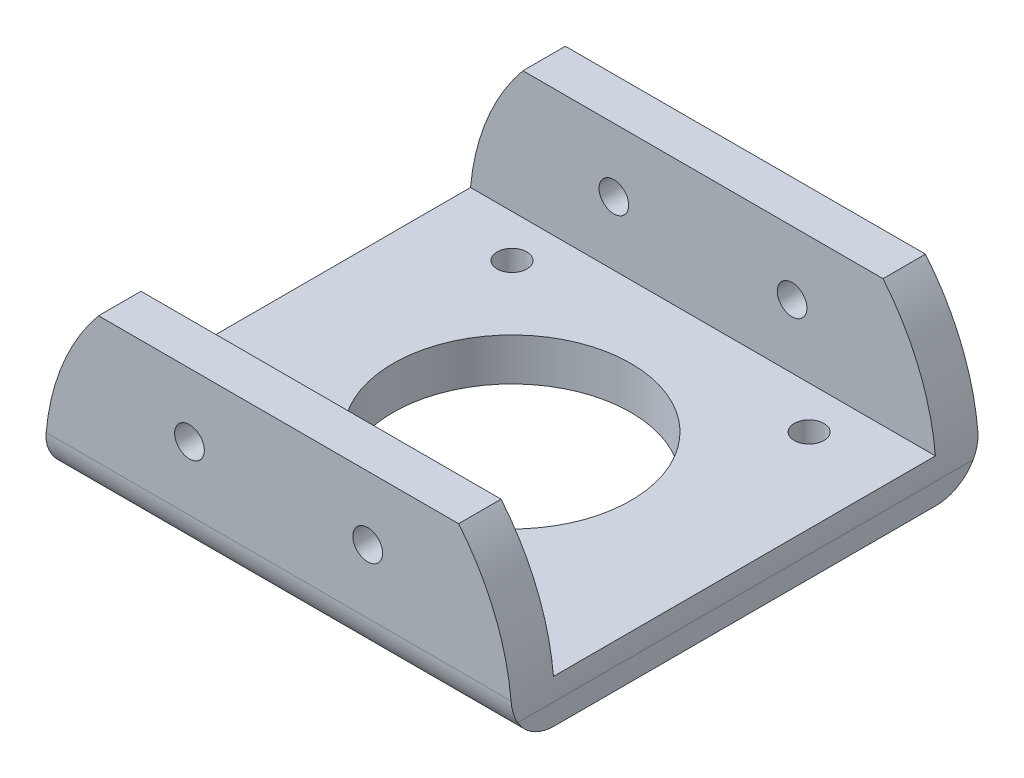
ISO-10303-21;
HEADER;
FILE_DESCRIPTION(('STEP AP214'),'2;1');
FILE_NAME('part.step','',(''),(''),'','','');
FILE_SCHEMA(('AUTOMOTIVE_DESIGN { 1 0 10303 214 1 1 1 1 }'));
ENDSEC;
DATA;
#1=APPLICATION_CONTEXT('core data for automotive mechanical design processes');
#2=APPLICATION_PROTOCOL_DEFINITION('international standard','automotive_design',2000,#1);
#3=PRODUCT_CONTEXT('',#1,'mechanical');
#4=PRODUCT('Part','Part','',(#3));
#5=PRODUCT_RELATED_PRODUCT_CATEGORY('part','',(#4));
#6=PRODUCT_DEFINITION_FORMATION('','',#4);
#7=PRODUCT_DEFINITION_CONTEXT('part definition',#1,'design');
#8=PRODUCT_DEFINITION('design','',#6,#7);
#9=PRODUCT_DEFINITION_SHAPE('','',#8);
#10=(LENGTH_UNIT() NAMED_UNIT(*) SI_UNIT(.MILLI.,.METRE.));
#11=(NAMED_UNIT(*) PLANE_ANGLE_UNIT() SI_UNIT($,.RADIAN.));
#12=(NAMED_UNIT(*) SI_UNIT($,.STERADIAN.) SOLID_ANGLE_UNIT());
#13=UNCERTAINTY_MEASURE_WITH_UNIT(LENGTH_MEASURE(1.E-05),#10,'distance_accuracy_value','');
#14=(GEOMETRIC_REPRESENTATION_CONTEXT(3) GLOBAL_UNCERTAINTY_ASSIGNED_CONTEXT((#13)) GLOBAL_UNIT_ASSIGNED_CONTEXT((#10,
#11,#12)) REPRESENTATION_CONTEXT('',''));
#15=CARTESIAN_POINT('',(0.,0.,0.));
#16=DIRECTION('',(0.,0.,1.));
#17=DIRECTION('',(1.,0.,0.));
#18=AXIS2_PLACEMENT_3D('',#15,#16,#17);
#19=CARTESIAN_POINT('',(27.5,5.,27.5));
#20=DIRECTION('',(-1.,0.,0.));
#21=DIRECTION('',(0.,0.,1.));
#22=AXIS2_PLACEMENT_3D('',#19,#20,#21);
#23=PLANE('',#22);
#24=DIRECTION('',(0.,0.,1.));
#25=VECTOR('',#24,1.);
#26=CARTESIAN_POINT('',(27.5,2.50000000000002,-27.5));
#27=LINE('',#26,#25);
#28=CARTESIAN_POINT('',(27.5,2.50000000000002,-26.8301270189222));
#29=VERTEX_POINT('',#28);
#30=CARTESIAN_POINT('',(27.5,2.50000000000002,26.8301270189222));
#31=VERTEX_POINT('',#30);
#32=EDGE_CURVE('E139',#29,#31,#27,.T.);
#33=ORIENTED_EDGE('',*,*,#32,.T.);
#34=CARTESIAN_POINT('',(27.5,5.,22.5));
#35=DIRECTION('',(-1.,0.,0.));
#36=DIRECTION('',(0.,0.,1.));
#37=AXIS2_PLACEMENT_3D('',#34,#35,#36);
#38=CIRCLE('',#37,5.);
#39=CARTESIAN_POINT('',(27.5,0.,22.5));
#40=VERTEX_POINT('',#39);
#41=EDGE_CURVE('E210',#31,#40,#38,.F.);
#42=ORIENTED_EDGE('',*,*,#41,.T.);
#43=DIRECTION('',(0.,0.,-1.));
#44=VECTOR('',#43,1.);
#45=CARTESIAN_POINT('',(27.5,0.,27.5));
#46=LINE('',#45,#44);
#47=CARTESIAN_POINT('',(27.5,0.,-22.5));
#48=VERTEX_POINT('',#47);
#49=EDGE_CURVE('E191',#40,#48,#46,.T.);
#50=ORIENTED_EDGE('',*,*,#49,.T.);
#51=CARTESIAN_POINT('',(27.5,5.,-22.5));
#52=DIRECTION('',(-1.,0.,0.));
#53=DIRECTION('',(0.,0.,1.));
#54=AXIS2_PLACEMENT_3D('',#51,#52,#53);
#55=CIRCLE('',#54,5.);
#56=EDGE_CURVE('E212',#48,#29,#55,.F.);
#57=ORIENTED_EDGE('',*,*,#56,.T.);
#58=EDGE_LOOP('',(#33,#42,#50,#57));
#59=FACE_BOUND('',#58,.T.);
#60=ADVANCED_FACE('F36',(#59),#23,.F.);
#61=CARTESIAN_POINT('',(0.,5.,0.));
#62=DIRECTION('',(0.,-1.,0.));
#63=DIRECTION('',(0.,0.,-1.));
#64=AXIS2_PLACEMENT_3D('',#61,#62,#63);
#65=PLANE('',#64);
#66=CARTESIAN_POINT('',(-17.5000000000002,5.,17.4999999999998));
#67=DIRECTION('',(0.,1.,0.));
#68=DIRECTION('',(0.,0.,1.));
#69=AXIS2_PLACEMENT_3D('',#66,#67,#68);
#70=CIRCLE('',#69,1.75);
#71=CARTESIAN_POINT('',(-17.5000000000002,5.,19.2499999999998));
#72=VERTEX_POINT('',#71);
#73=EDGE_CURVE('E158',#72,#72,#70,.T.);
#74=ORIENTED_EDGE('',*,*,#73,.F.);
#75=EDGE_LOOP('',(#74));
#76=FACE_BOUND('',#75,.T.);
#77=CARTESIAN_POINT('',(17.4999999999999,5.,17.5000000000001));
#78=DIRECTION('',(0.,1.,0.));
#79=DIRECTION('',(0.,0.,1.));
#80=AXIS2_PLACEMENT_3D('',#77,#78,#79);
#81=CIRCLE('',#80,1.75);
#82=CARTESIAN_POINT('',(17.4999999999999,5.,19.2500000000001));
#83=VERTEX_POINT('',#82);
#84=EDGE_CURVE('E180',#83,#83,#81,.T.);
#85=ORIENTED_EDGE('',*,*,#84,.F.);
#86=EDGE_LOOP('',(#85));
#87=FACE_BOUND('',#86,.T.);
#88=CARTESIAN_POINT('',(17.5000000000001,5.,-17.5));
#89=DIRECTION('',(0.,1.,0.));
#90=DIRECTION('',(0.,0.,1.));
#91=AXIS2_PLACEMENT_3D('',#88,#89,#90);
#92=CIRCLE('',#91,1.75);
#93=CARTESIAN_POINT('',(17.5000000000001,5.,-15.75));
#94=VERTEX_POINT('',#93);
#95=EDGE_CURVE('E174',#94,#94,#92,.T.);
#96=ORIENTED_EDGE('',*,*,#95,.F.);
#97=EDGE_LOOP('',(#96));
#98=FACE_BOUND('',#97,.T.);
#99=CARTESIAN_POINT('',(-17.5,5.,-17.5));
#100=DIRECTION('',(0.,1.,0.));
#101=DIRECTION('',(0.,0.,1.));
#102=AXIS2_PLACEMENT_3D('',#99,#100,#101);
#103=CIRCLE('',#102,1.75);
#104=CARTESIAN_POINT('',(-17.5,5.,-15.75));
#105=VERTEX_POINT('',#104);
#106=EDGE_CURVE('E167',#105,#105,#103,.T.);
#107=ORIENTED_EDGE('',*,*,#106,.F.);
#108=EDGE_LOOP('',(#107));
#109=FACE_BOUND('',#108,.T.);
#110=CARTESIAN_POINT('',(0.,5.,0.));
#111=DIRECTION('',(0.,1.,0.));
#112=DIRECTION('',(0.,0.,1.));
#113=AXIS2_PLACEMENT_3D('',#110,#111,#112);
#114=CIRCLE('',#113,14.);
#115=CARTESIAN_POINT('',(0.,5.,14.));
#116=VERTEX_POINT('',#115);
#117=EDGE_CURVE('E188',#116,#116,#114,.T.);
#118=ORIENTED_EDGE('',*,*,#117,.F.);
#119=EDGE_LOOP('',(#118));
#120=FACE_BOUND('',#119,.T.);
#121=DIRECTION('',(-1.,0.,0.));
#122=VECTOR('',#121,1.);
#123=CARTESIAN_POINT('',(-27.5,5.,22.5));
#124=LINE('',#123,#122);
#125=CARTESIAN_POINT('',(27.3861278752583,5.,22.5));
#126=VERTEX_POINT('',#125);
#127=CARTESIAN_POINT('',(-27.3861278752583,5.,22.5));
#128=VERTEX_POINT('',#127);
#129=EDGE_CURVE('E289',#126,#128,#124,.T.);
#130=ORIENTED_EDGE('',*,*,#129,.F.);
#131=DIRECTION('',(0.,0.,1.));
#132=VECTOR('',#131,1.);
#133=CARTESIAN_POINT('',(27.3861278752583,5.,-27.5));
#134=LINE('',#133,#132);
#135=CARTESIAN_POINT('',(27.3861278752583,5.,-22.5));
#136=VERTEX_POINT('',#135);
#137=EDGE_CURVE('E269',#126,#136,#134,.F.);
#138=ORIENTED_EDGE('',*,*,#137,.T.);
#139=DIRECTION('',(1.,0.,0.));
#140=VECTOR('',#139,1.);
#141=CARTESIAN_POINT('',(-27.5,5.,-22.5));
#142=LINE('',#141,#140);
#143=CARTESIAN_POINT('',(-27.3861278752583,5.,-22.5));
#144=VERTEX_POINT('',#143);
#145=EDGE_CURVE('E160',#144,#136,#142,.T.);
#146=ORIENTED_EDGE('',*,*,#145,.F.);
#147=DIRECTION('',(0.,0.,1.));
#148=VECTOR('',#147,1.);
#149=CARTESIAN_POINT('',(-27.3861278752583,5.,-27.5));
#150=LINE('',#149,#148);
#151=EDGE_CURVE('E304',#144,#128,#150,.T.);
#152=ORIENTED_EDGE('',*,*,#151,.T.);
#153=EDGE_LOOP('',(#130,#138,#146,#152));
#154=FACE_BOUND('',#153,.T.);
#155=ADVANCED_FACE('F302',(#76,#87,#98,#109,#120,#154),#65,.F.);
#156=CARTESIAN_POINT('',(-27.5,5.,-27.5));
#157=DIRECTION('',(0.,0.,1.));
#158=DIRECTION('',(1.,0.,0.));
#159=AXIS2_PLACEMENT_3D('',#156,#157,#158);
#160=PLANE('',#159);
#161=CARTESIAN_POINT('',(10.5,12.5,-27.5));
#162=DIRECTION('',(0.,0.,-1.));
#163=DIRECTION('',(-1.,0.,0.));
#164=AXIS2_PLACEMENT_3D('',#161,#162,#163);
#165=CIRCLE('',#164,1.75);
#166=CARTESIAN_POINT('',(8.75,12.5,-27.5));
#167=VERTEX_POINT('',#166);
#168=EDGE_CURVE('E277',#167,#167,#165,.T.);
#169=ORIENTED_EDGE('',*,*,#168,.F.);
#170=EDGE_LOOP('',(#169));
#171=FACE_BOUND('',#170,.T.);
#172=CARTESIAN_POINT('',(-10.5,12.5,-27.5));
#173=DIRECTION('',(0.,0.,-1.));
#174=DIRECTION('',(1.,0.,0.));
#175=AXIS2_PLACEMENT_3D('',#172,#173,#174);
#176=CIRCLE('',#175,1.75);
#177=CARTESIAN_POINT('',(-8.75,12.5,-27.5));
#178=VERTEX_POINT('',#177);
#179=EDGE_CURVE('E274',#178,#178,#176,.T.);
#180=ORIENTED_EDGE('',*,*,#179,.F.);
#181=EDGE_LOOP('',(#180));
#182=FACE_BOUND('',#181,.T.);
#183=DIRECTION('',(-1.,0.,0.));
#184=VECTOR('',#183,1.);
#185=CARTESIAN_POINT('',(-27.5,20.,-27.5));
#186=LINE('',#185,#184);
#187=CARTESIAN_POINT('',(21.2132034355965,20.,-27.5));
#188=VERTEX_POINT('',#187);
#189=CARTESIAN_POINT('',(-21.2132034355964,20.,-27.5));
#190=VERTEX_POINT('',#189);
#191=EDGE_CURVE('E146',#188,#190,#186,.T.);
#192=ORIENTED_EDGE('',*,*,#191,.F.);
#193=CARTESIAN_POINT('',(0.,2.50000000000002,-27.5));
#194=DIRECTION('',(0.,0.,-1.));
#195=DIRECTION('',(1.,0.,0.));
#196=AXIS2_PLACEMENT_3D('',#193,#194,#195);
#197=CIRCLE('',#196,27.5);
#198=CARTESIAN_POINT('',(27.3861278752583,5.,-27.5));
#199=VERTEX_POINT('',#198);
#200=EDGE_CURVE('E128',#188,#199,#197,.T.);
#201=ORIENTED_EDGE('',*,*,#200,.T.);
#202=DIRECTION('',(-1.,0.,0.));
#203=VECTOR('',#202,1.);
#204=CARTESIAN_POINT('',(-27.5,5.,-27.5));
#205=LINE('',#204,#203);
#206=CARTESIAN_POINT('',(-27.3861278752583,5.,-27.5));
#207=VERTEX_POINT('',#206);
#208=EDGE_CURVE('E199',#199,#207,#205,.T.);
#209=ORIENTED_EDGE('',*,*,#208,.T.);
#210=CARTESIAN_POINT('',(0.,2.50000000000002,-27.5));
#211=DIRECTION('',(0.,0.,-1.));
#212=DIRECTION('',(1.,0.,0.));
#213=AXIS2_PLACEMENT_3D('',#210,#211,#212);
#214=CIRCLE('',#213,27.5);
#215=EDGE_CURVE('E154',#207,#190,#214,.T.);
#216=ORIENTED_EDGE('',*,*,#215,.T.);
#217=EDGE_LOOP('',(#192,#201,#209,#216));
#218=FACE_BOUND('',#217,.T.);
#219=ADVANCED_FACE('F153',(#171,#182,#218),#160,.F.);
#220=CARTESIAN_POINT('',(-27.5,5.,27.5));
#221=DIRECTION('',(1.,0.,0.));
#222=DIRECTION('',(0.,0.,-1.));
#223=AXIS2_PLACEMENT_3D('',#220,#221,#222);
#224=PLANE('',#223);
#225=CARTESIAN_POINT('',(-27.5,5.,22.5));
#226=DIRECTION('',(1.,0.,0.));
#227=DIRECTION('',(0.,0.,-1.));
#228=AXIS2_PLACEMENT_3D('',#225,#226,#227);
#229=CIRCLE('',#228,5.);
#230=CARTESIAN_POINT('',(-27.5,0.,22.5));
#231=VERTEX_POINT('',#230);
#232=CARTESIAN_POINT('',(-27.5,2.50000000000002,26.8301270189222));
#233=VERTEX_POINT('',#232);
#234=EDGE_CURVE('E201',#231,#233,#229,.F.);
#235=ORIENTED_EDGE('',*,*,#234,.T.);
#236=DIRECTION('',(0.,0.,1.));
#237=VECTOR('',#236,1.);
#238=CARTESIAN_POINT('',(-27.5,2.50000000000002,-27.5));
#239=LINE('',#238,#237);
#240=CARTESIAN_POINT('',(-27.5,2.50000000000002,-26.8301270189222));
#241=VERTEX_POINT('',#240);
#242=EDGE_CURVE('E64',#241,#233,#239,.T.);
#243=ORIENTED_EDGE('',*,*,#242,.F.);
#244=CARTESIAN_POINT('',(-27.5,5.,-22.5));
#245=DIRECTION('',(1.,0.,0.));
#246=DIRECTION('',(0.,0.,-1.));
#247=AXIS2_PLACEMENT_3D('',#244,#245,#246);
#248=CIRCLE('',#247,5.);
#249=CARTESIAN_POINT('',(-27.5,0.,-22.5));
#250=VERTEX_POINT('',#249);
#251=EDGE_CURVE('E204',#241,#250,#248,.F.);
#252=ORIENTED_EDGE('',*,*,#251,.T.);
#253=DIRECTION('',(0.,0.,1.));
#254=VECTOR('',#253,1.);
#255=CARTESIAN_POINT('',(-27.5,0.,27.5));
#256=LINE('',#255,#254);
#257=EDGE_CURVE('E196',#250,#231,#256,.T.);
#258=ORIENTED_EDGE('',*,*,#257,.T.);
#259=EDGE_LOOP('',(#235,#243,#252,#258));
#260=FACE_BOUND('',#259,.T.);
#261=ADVANCED_FACE('F341',(#260),#224,.F.);
#262=CARTESIAN_POINT('',(-27.5,5.,27.5));
#263=DIRECTION('',(0.,0.,-1.));
#264=DIRECTION('',(-1.,0.,0.));
#265=AXIS2_PLACEMENT_3D('',#262,#263,#264);
#266=PLANE('',#265);
#267=CARTESIAN_POINT('',(10.5,12.5,27.5));
#268=DIRECTION('',(0.,0.,-1.));
#269=DIRECTION('',(-1.,0.,0.));
#270=AXIS2_PLACEMENT_3D('',#267,#268,#269);
#271=CIRCLE('',#270,1.75);
#272=CARTESIAN_POINT('',(8.75,12.5,27.5));
#273=VERTEX_POINT('',#272);
#274=EDGE_CURVE('E222',#273,#273,#271,.T.);
#275=ORIENTED_EDGE('',*,*,#274,.T.);
#276=EDGE_LOOP('',(#275));
#277=FACE_BOUND('',#276,.T.);
#278=CARTESIAN_POINT('',(-10.5,12.5,27.5));
#279=DIRECTION('',(0.,0.,-1.));
#280=DIRECTION('',(1.,0.,0.));
#281=AXIS2_PLACEMENT_3D('',#278,#279,#280);
#282=CIRCLE('',#281,1.75);
#283=CARTESIAN_POINT('',(-8.75,12.5,27.5));
#284=VERTEX_POINT('',#283);
#285=EDGE_CURVE('E280',#284,#284,#282,.T.);
#286=ORIENTED_EDGE('',*,*,#285,.T.);
#287=EDGE_LOOP('',(#286));
#288=FACE_BOUND('',#287,.T.);
#289=DIRECTION('',(1.,0.,0.));
#290=VECTOR('',#289,1.);
#291=CARTESIAN_POINT('',(27.5,5.,27.5));
#292=LINE('',#291,#290);
#293=CARTESIAN_POINT('',(-27.3861278752583,5.,27.5));
#294=VERTEX_POINT('',#293);
#295=CARTESIAN_POINT('',(27.3861278752583,5.,27.5));
#296=VERTEX_POINT('',#295);
#297=EDGE_CURVE('E215',#294,#296,#292,.T.);
#298=ORIENTED_EDGE('',*,*,#297,.T.);
#299=CARTESIAN_POINT('',(0.,2.50000000000002,27.5));
#300=DIRECTION('',(0.,0.,-1.));
#301=DIRECTION('',(1.,0.,0.));
#302=AXIS2_PLACEMENT_3D('',#299,#300,#301);
#303=CIRCLE('',#302,27.5);
#304=CARTESIAN_POINT('',(21.2132034355965,20.,27.5));
#305=VERTEX_POINT('',#304);
#306=EDGE_CURVE('E56',#305,#296,#303,.T.);
#307=ORIENTED_EDGE('',*,*,#306,.F.);
#308=DIRECTION('',(1.,0.,0.));
#309=VECTOR('',#308,1.);
#310=CARTESIAN_POINT('',(-27.5,20.,27.5));
#311=LINE('',#310,#309);
#312=CARTESIAN_POINT('',(-21.2132034355964,20.,27.5));
#313=VERTEX_POINT('',#312);
#314=EDGE_CURVE('E290',#313,#305,#311,.T.);
#315=ORIENTED_EDGE('',*,*,#314,.F.);
#316=CARTESIAN_POINT('',(0.,2.50000000000002,27.5));
#317=DIRECTION('',(0.,0.,-1.));
#318=DIRECTION('',(1.,0.,0.));
#319=AXIS2_PLACEMENT_3D('',#316,#317,#318);
#320=CIRCLE('',#319,27.5);
#321=EDGE_CURVE('E312',#294,#313,#320,.T.);
#322=ORIENTED_EDGE('',*,*,#321,.F.);
#323=EDGE_LOOP('',(#298,#307,#315,#322));
#324=FACE_BOUND('',#323,.T.);
#325=ADVANCED_FACE('F322',(#277,#288,#324),#266,.F.);
#326=CARTESIAN_POINT('',(0.,0.,0.));
#327=DIRECTION('',(0.,-1.,0.));
#328=DIRECTION('',(0.,0.,-1.));
#329=AXIS2_PLACEMENT_3D('',#326,#327,#328);
#330=PLANE('',#329);
#331=CARTESIAN_POINT('',(-17.5000000000002,0.,17.4999999999998));
#332=DIRECTION('',(0.,-1.,0.));
#333=DIRECTION('',(0.,0.,-1.));
#334=AXIS2_PLACEMENT_3D('',#331,#332,#333);
#335=CIRCLE('',#334,1.75);
#336=CARTESIAN_POINT('',(-17.5000000000002,0.,15.7499999999998));
#337=VERTEX_POINT('',#336);
#338=EDGE_CURVE('E155',#337,#337,#335,.F.);
#339=ORIENTED_EDGE('',*,*,#338,.T.);
#340=EDGE_LOOP('',(#339));
#341=FACE_BOUND('',#340,.T.);
#342=CARTESIAN_POINT('',(17.4999999999999,0.,17.5000000000001));
#343=DIRECTION('',(0.,-1.,0.));
#344=DIRECTION('',(0.,0.,-1.));
#345=AXIS2_PLACEMENT_3D('',#342,#343,#344);
#346=CIRCLE('',#345,1.75);
#347=CARTESIAN_POINT('',(17.4999999999999,0.,15.7500000000001));
#348=VERTEX_POINT('',#347);
#349=EDGE_CURVE('E183',#348,#348,#346,.F.);
#350=ORIENTED_EDGE('',*,*,#349,.T.);
#351=EDGE_LOOP('',(#350));
#352=FACE_BOUND('',#351,.T.);
#353=CARTESIAN_POINT('',(17.5000000000001,0.,-17.5));
#354=DIRECTION('',(0.,-1.,0.));
#355=DIRECTION('',(0.,0.,-1.));
#356=AXIS2_PLACEMENT_3D('',#353,#354,#355);
#357=CIRCLE('',#356,1.75);
#358=CARTESIAN_POINT('',(17.5000000000001,0.,-19.2499999999999));
#359=VERTEX_POINT('',#358);
#360=EDGE_CURVE('E177',#359,#359,#357,.F.);
#361=ORIENTED_EDGE('',*,*,#360,.T.);
#362=EDGE_LOOP('',(#361));
#363=FACE_BOUND('',#362,.T.);
#364=CARTESIAN_POINT('',(-17.5,0.,-17.5));
#365=DIRECTION('',(0.,-1.,0.));
#366=DIRECTION('',(0.,0.,-1.));
#367=AXIS2_PLACEMENT_3D('',#364,#365,#366);
#368=CIRCLE('',#367,1.75);
#369=CARTESIAN_POINT('',(-17.5,0.,-19.25));
#370=VERTEX_POINT('',#369);
#371=EDGE_CURVE('E171',#370,#370,#368,.F.);
#372=ORIENTED_EDGE('',*,*,#371,.T.);
#373=EDGE_LOOP('',(#372));
#374=FACE_BOUND('',#373,.T.);
#375=CARTESIAN_POINT('',(0.,0.,0.));
#376=DIRECTION('',(0.,-1.,0.));
#377=DIRECTION('',(0.,0.,-1.));
#378=AXIS2_PLACEMENT_3D('',#375,#376,#377);
#379=CIRCLE('',#378,14.);
#380=CARTESIAN_POINT('',(0.,0.,-14.));
#381=VERTEX_POINT('',#380);
#382=EDGE_CURVE('E170',#381,#381,#379,.F.);
#383=ORIENTED_EDGE('',*,*,#382,.T.);
#384=EDGE_LOOP('',(#383));
#385=FACE_BOUND('',#384,.T.);
#386=ORIENTED_EDGE('',*,*,#257,.F.);
#387=DIRECTION('',(-1.,0.,0.));
#388=VECTOR('',#387,1.);
#389=CARTESIAN_POINT('',(27.5,0.,-22.5));
#390=LINE('',#389,#388);
#391=EDGE_CURVE('E208',#250,#48,#390,.F.);
#392=ORIENTED_EDGE('',*,*,#391,.T.);
#393=ORIENTED_EDGE('',*,*,#49,.F.);
#394=DIRECTION('',(1.,0.,0.));
#395=VECTOR('',#394,1.);
#396=CARTESIAN_POINT('',(-27.5,0.,22.5));
#397=LINE('',#396,#395);
#398=EDGE_CURVE('E206',#40,#231,#397,.F.);
#399=ORIENTED_EDGE('',*,*,#398,.T.);
#400=EDGE_LOOP('',(#386,#392,#393,#399));
#401=FACE_BOUND('',#400,.T.);
#402=ADVANCED_FACE('F349',(#341,#352,#363,#374,#385,#401),#330,.T.);
#403=CARTESIAN_POINT('',(0.,-0.00100000000000013,0.));
#404=DIRECTION('',(0.,1.,0.));
#405=DIRECTION('',(0.,0.,1.));
#406=AXIS2_PLACEMENT_3D('',#403,#404,#405);
#407=CYLINDRICAL_SURFACE('',#406,14.);
#408=ORIENTED_EDGE('',*,*,#382,.F.);
#409=EDGE_LOOP('',(#408));
#410=FACE_BOUND('',#409,.T.);
#411=ORIENTED_EDGE('',*,*,#117,.T.);
#412=EDGE_LOOP('',(#411));
#413=FACE_BOUND('',#412,.T.);
#414=ADVANCED_FACE('F347',(#410,#413),#407,.F.);
#415=CARTESIAN_POINT('',(-17.5,-0.00100000000000013,-17.5));
#416=DIRECTION('',(0.,1.,0.));
#417=DIRECTION('',(0.,0.,1.));
#418=AXIS2_PLACEMENT_3D('',#415,#416,#417);
#419=CYLINDRICAL_SURFACE('',#418,1.75);
#420=ORIENTED_EDGE('',*,*,#371,.F.);
#421=EDGE_LOOP('',(#420));
#422=FACE_BOUND('',#421,.T.);
#423=ORIENTED_EDGE('',*,*,#106,.T.);
#424=EDGE_LOOP('',(#423));
#425=FACE_BOUND('',#424,.T.);
#426=ADVANCED_FACE('F406',(#422,#425),#419,.F.);
#427=CARTESIAN_POINT('',(17.5000000000001,-0.00100000000000013,-17.5));
#428=DIRECTION('',(0.,1.,0.));
#429=DIRECTION('',(0.,0.,1.));
#430=AXIS2_PLACEMENT_3D('',#427,#428,#429);
#431=CYLINDRICAL_SURFACE('',#430,1.75);
#432=ORIENTED_EDGE('',*,*,#360,.F.);
#433=EDGE_LOOP('',(#432));
#434=FACE_BOUND('',#433,.T.);
#435=ORIENTED_EDGE('',*,*,#95,.T.);
#436=EDGE_LOOP('',(#435));
#437=FACE_BOUND('',#436,.T.);
#438=ADVANCED_FACE('F409',(#434,#437),#431,.F.);
#439=CARTESIAN_POINT('',(17.4999999999999,-0.00100000000000013,17.5000000000001));
#440=DIRECTION('',(0.,1.,0.));
#441=DIRECTION('',(0.,0.,1.));
#442=AXIS2_PLACEMENT_3D('',#439,#440,#441);
#443=CYLINDRICAL_SURFACE('',#442,1.75);
#444=ORIENTED_EDGE('',*,*,#349,.F.);
#445=EDGE_LOOP('',(#444));
#446=FACE_BOUND('',#445,.T.);
#447=ORIENTED_EDGE('',*,*,#84,.T.);
#448=EDGE_LOOP('',(#447));
#449=FACE_BOUND('',#448,.T.);
#450=ADVANCED_FACE('F403',(#446,#449),#443,.F.);
#451=CARTESIAN_POINT('',(-17.5000000000002,-0.00100000000000013,17.4999999999998));
#452=DIRECTION('',(0.,1.,0.));
#453=DIRECTION('',(0.,0.,1.));
#454=AXIS2_PLACEMENT_3D('',#451,#452,#453);
#455=CYLINDRICAL_SURFACE('',#454,1.75);
#456=ORIENTED_EDGE('',*,*,#338,.F.);
#457=EDGE_LOOP('',(#456));
#458=FACE_BOUND('',#457,.T.);
#459=ORIENTED_EDGE('',*,*,#73,.T.);
#460=EDGE_LOOP('',(#459));
#461=FACE_BOUND('',#460,.T.);
#462=ADVANCED_FACE('F395',(#458,#461),#455,.F.);
#463=CARTESIAN_POINT('',(-27.5,20.,-22.5));
#464=DIRECTION('',(0.,0.,-1.));
#465=DIRECTION('',(-1.,0.,0.));
#466=AXIS2_PLACEMENT_3D('',#463,#464,#465);
#467=PLANE('',#466);
#468=CARTESIAN_POINT('',(10.5,12.5,-22.5));
#469=DIRECTION('',(0.,0.,-1.));
#470=DIRECTION('',(-1.,0.,0.));
#471=AXIS2_PLACEMENT_3D('',#468,#469,#470);
#472=CIRCLE('',#471,1.75);
#473=CARTESIAN_POINT('',(8.75,12.5,-22.5));
#474=VERTEX_POINT('',#473);
#475=EDGE_CURVE('E225',#474,#474,#472,.T.);
#476=ORIENTED_EDGE('',*,*,#475,.T.);
#477=EDGE_LOOP('',(#476));
#478=FACE_BOUND('',#477,.T.);
#479=CARTESIAN_POINT('',(-10.5,12.5,-22.5));
#480=DIRECTION('',(0.,0.,-1.));
#481=DIRECTION('',(-1.,0.,0.));
#482=AXIS2_PLACEMENT_3D('',#479,#480,#481);
#483=CIRCLE('',#482,1.75);
#484=CARTESIAN_POINT('',(-12.25,12.5,-22.5));
#485=VERTEX_POINT('',#484);
#486=EDGE_CURVE('E221',#485,#485,#483,.T.);
#487=ORIENTED_EDGE('',*,*,#486,.T.);
#488=EDGE_LOOP('',(#487));
#489=FACE_BOUND('',#488,.T.);
#490=ORIENTED_EDGE('',*,*,#145,.T.);
#491=CARTESIAN_POINT('',(0.,2.50000000000002,-22.5));
#492=DIRECTION('',(0.,0.,-1.));
#493=DIRECTION('',(-1.,0.,0.));
#494=AXIS2_PLACEMENT_3D('',#491,#492,#493);
#495=CIRCLE('',#494,27.5);
#496=CARTESIAN_POINT('',(21.2132034355965,20.,-22.5));
#497=VERTEX_POINT('',#496);
#498=EDGE_CURVE('E272',#136,#497,#495,.F.);
#499=ORIENTED_EDGE('',*,*,#498,.T.);
#500=DIRECTION('',(1.,0.,0.));
#501=VECTOR('',#500,1.);
#502=CARTESIAN_POINT('',(-27.5,20.,-22.5));
#503=LINE('',#502,#501);
#504=CARTESIAN_POINT('',(-21.2132034355964,20.,-22.5));
#505=VERTEX_POINT('',#504);
#506=EDGE_CURVE('E148',#505,#497,#503,.T.);
#507=ORIENTED_EDGE('',*,*,#506,.F.);
#508=CARTESIAN_POINT('',(0.,2.50000000000002,-22.5));
#509=DIRECTION('',(0.,0.,-1.));
#510=DIRECTION('',(-1.,0.,0.));
#511=AXIS2_PLACEMENT_3D('',#508,#509,#510);
#512=CIRCLE('',#511,27.5);
#513=EDGE_CURVE('E266',#505,#144,#512,.F.);
#514=ORIENTED_EDGE('',*,*,#513,.T.);
#515=EDGE_LOOP('',(#490,#499,#507,#514));
#516=FACE_BOUND('',#515,.T.);
#517=ADVANCED_FACE('F307',(#478,#489,#516),#467,.F.);
#518=CARTESIAN_POINT('',(0.,20.,0.));
#519=DIRECTION('',(0.,1.,0.));
#520=DIRECTION('',(0.,0.,1.));
#521=AXIS2_PLACEMENT_3D('',#518,#519,#520);
#522=PLANE('',#521);
#523=DIRECTION('',(0.,0.,1.));
#524=VECTOR('',#523,1.);
#525=CARTESIAN_POINT('',(21.2132034355965,20.,-27.5));
#526=LINE('',#525,#524);
#527=EDGE_CURVE('E131',#188,#497,#526,.T.);
#528=ORIENTED_EDGE('',*,*,#527,.F.);
#529=ORIENTED_EDGE('',*,*,#191,.T.);
#530=DIRECTION('',(0.,0.,1.));
#531=VECTOR('',#530,1.);
#532=CARTESIAN_POINT('',(-21.2132034355964,20.,-27.5));
#533=LINE('',#532,#531);
#534=EDGE_CURVE('E247',#190,#505,#533,.T.);
#535=ORIENTED_EDGE('',*,*,#534,.T.);
#536=ORIENTED_EDGE('',*,*,#506,.T.);
#537=EDGE_LOOP('',(#528,#529,#535,#536));
#538=FACE_BOUND('',#537,.T.);
#539=ADVANCED_FACE('F144',(#538),#522,.T.);
#540=CARTESIAN_POINT('',(-27.5,20.,22.5));
#541=DIRECTION('',(0.,0.,1.));
#542=DIRECTION('',(1.,0.,0.));
#543=AXIS2_PLACEMENT_3D('',#540,#541,#542);
#544=PLANE('',#543);
#545=CARTESIAN_POINT('',(10.5,12.5,22.5));
#546=DIRECTION('',(0.,0.,1.));
#547=DIRECTION('',(1.,0.,0.));
#548=AXIS2_PLACEMENT_3D('',#545,#546,#547);
#549=CIRCLE('',#548,1.75);
#550=CARTESIAN_POINT('',(12.25,12.5,22.5));
#551=VERTEX_POINT('',#550);
#552=EDGE_CURVE('E223',#551,#551,#549,.T.);
#553=ORIENTED_EDGE('',*,*,#552,.T.);
#554=EDGE_LOOP('',(#553));
#555=FACE_BOUND('',#554,.T.);
#556=CARTESIAN_POINT('',(-10.5,12.5,22.5));
#557=DIRECTION('',(0.,0.,1.));
#558=DIRECTION('',(1.,0.,0.));
#559=AXIS2_PLACEMENT_3D('',#556,#557,#558);
#560=CIRCLE('',#559,1.75);
#561=CARTESIAN_POINT('',(-8.75,12.5,22.5));
#562=VERTEX_POINT('',#561);
#563=EDGE_CURVE('E218',#562,#562,#560,.T.);
#564=ORIENTED_EDGE('',*,*,#563,.T.);
#565=EDGE_LOOP('',(#564));
#566=FACE_BOUND('',#565,.T.);
#567=DIRECTION('',(-1.,0.,0.));
#568=VECTOR('',#567,1.);
#569=CARTESIAN_POINT('',(-27.5,20.,22.5));
#570=LINE('',#569,#568);
#571=CARTESIAN_POINT('',(21.2132034355965,20.,22.5));
#572=VERTEX_POINT('',#571);
#573=CARTESIAN_POINT('',(-21.2132034355964,20.,22.5));
#574=VERTEX_POINT('',#573);
#575=EDGE_CURVE('E166',#572,#574,#570,.T.);
#576=ORIENTED_EDGE('',*,*,#575,.F.);
#577=CARTESIAN_POINT('',(0.,2.50000000000002,22.5));
#578=DIRECTION('',(0.,0.,1.));
#579=DIRECTION('',(1.,0.,0.));
#580=AXIS2_PLACEMENT_3D('',#577,#578,#579);
#581=CIRCLE('',#580,27.5);
#582=EDGE_CURVE('E265',#572,#126,#581,.F.);
#583=ORIENTED_EDGE('',*,*,#582,.T.);
#584=ORIENTED_EDGE('',*,*,#129,.T.);
#585=CARTESIAN_POINT('',(0.,2.50000000000002,22.5));
#586=DIRECTION('',(0.,0.,1.));
#587=DIRECTION('',(1.,0.,0.));
#588=AXIS2_PLACEMENT_3D('',#585,#586,#587);
#589=CIRCLE('',#588,27.5);
#590=EDGE_CURVE('E246',#128,#574,#589,.F.);
#591=ORIENTED_EDGE('',*,*,#590,.T.);
#592=EDGE_LOOP('',(#576,#583,#584,#591));
#593=FACE_BOUND('',#592,.T.);
#594=ADVANCED_FACE('F299',(#555,#566,#593),#544,.F.);
#595=CARTESIAN_POINT('',(0.,20.,0.));
#596=DIRECTION('',(0.,-1.,0.));
#597=DIRECTION('',(0.,0.,-1.));
#598=AXIS2_PLACEMENT_3D('',#595,#596,#597);
#599=PLANE('',#598);
#600=ORIENTED_EDGE('',*,*,#314,.T.);
#601=EDGE_CURVE('E150',#572,#305,#526,.T.);
#602=ORIENTED_EDGE('',*,*,#601,.F.);
#603=ORIENTED_EDGE('',*,*,#575,.T.);
#604=EDGE_CURVE('E308',#574,#313,#533,.T.);
#605=ORIENTED_EDGE('',*,*,#604,.T.);
#606=EDGE_LOOP('',(#600,#602,#603,#605));
#607=FACE_BOUND('',#606,.T.);
#608=ADVANCED_FACE('F254',(#607),#599,.F.);
#609=CARTESIAN_POINT('',(-27.5,5.,-22.5));
#610=DIRECTION('',(1.,0.,0.));
#611=DIRECTION('',(0.,0.,-1.));
#612=AXIS2_PLACEMENT_3D('',#609,#610,#611);
#613=CYLINDRICAL_SURFACE('',#612,5.);
#614=CARTESIAN_POINT('',(27.5,2.50000000000002,-26.8301270189222));
#615=CARTESIAN_POINT('',(27.5000075216851,2.62155394953633,-26.9003254065735));
#616=CARTESIAN_POINT('',(27.4991944407398,2.74608050731644,-26.9653769967545));
#617=CARTESIAN_POINT('',(27.4957426406674,3.00017371500055,-27.084796859885));
#618=CARTESIAN_POINT('',(27.4931034055761,3.12974177957231,-27.1391621079238));
#619=CARTESIAN_POINT('',(27.4858942918672,3.39006724816333,-27.2357128118496));
#620=CARTESIAN_POINT('',(27.4813678636557,3.5207367869329,-27.2781384688659));
#621=CARTESIAN_POINT('',(27.4702803732087,3.7849856696188,-27.3520675787124));
#622=CARTESIAN_POINT('',(27.463720114278,3.91856384537339,-27.3835753334151));
#623=CARTESIAN_POINT('',(27.4473308881328,4.2082359138182,-27.439435868237));
#624=CARTESIAN_POINT('',(27.437156485622,4.36466373227348,-27.4619710361739));
#625=CARTESIAN_POINT('',(27.413864682657,4.68076428101597,-27.4923646284709));
#626=CARTESIAN_POINT('',(27.4007111203811,4.84045287162294,-27.5000305972368));
#627=CARTESIAN_POINT('',(27.3861278752583,5.,-27.5));
#628=B_SPLINE_CURVE_WITH_KNOTS('',3,(#614,#615,#616,#617,#618,#619,#620,#621,#622,#623,#624,
#625,#626,#627),.UNSPECIFIED.,.F.,.F.,(4,2,2,2,2,2,4),(0.,0.420978535697469,0.842076063882164,
1.25397141428334,1.66570428461886,2.14007223236475,2.62054011084537),.UNSPECIFIED.);
#629=EDGE_CURVE('E134',#29,#199,#628,.T.);
#630=ORIENTED_EDGE('',*,*,#629,.F.);
#631=ORIENTED_EDGE('',*,*,#56,.F.);
#632=ORIENTED_EDGE('',*,*,#391,.F.);
#633=ORIENTED_EDGE('',*,*,#251,.F.);
#634=CARTESIAN_POINT('',(-27.3861278752583,5.,-27.5));
#635=CARTESIAN_POINT('',(-27.398899331126,4.86021459225667,-27.5000168978971));
#636=CARTESIAN_POINT('',(-27.4105794842346,4.72032800520016,-27.4941385583102));
#637=CARTESIAN_POINT('',(-27.4317450290683,4.44133535107201,-27.4706590637365));
#638=CARTESIAN_POINT('',(-27.4412298051237,4.30222951359921,-27.453054625647));
#639=CARTESIAN_POINT('',(-27.4578022189489,4.02887995232286,-27.4067026401091));
#640=CARTESIAN_POINT('',(-27.4649377049764,3.89459640299817,-27.3782069685381));
#641=CARTESIAN_POINT('',(-27.4771453980759,3.62879502466497,-27.3102609175283));
#642=CARTESIAN_POINT('',(-27.4822184154057,3.49727612883317,-27.2708148503119));
#643=CARTESIAN_POINT('',(-27.4910274637477,3.21812840041679,-27.1743882599219));
#644=CARTESIAN_POINT('',(-27.4944427068491,3.07109244791874,-27.1156531710209));
#645=CARTESIAN_POINT('',(-27.4989509165078,2.78135483692428,-26.9836771709354));
#646=CARTESIAN_POINT('',(-27.5000134567153,2.63873322430109,-26.9102594443053));
#647=CARTESIAN_POINT('',(-27.5,2.50000000000003,-26.8301270189222));
#648=B_SPLINE_CURVE_WITH_KNOTS('',3,(#634,#635,#636,#637,#638,#639,#640,#641,#642,#643,#644,
#645,#646,#647),.UNSPECIFIED.,.F.,.F.,(4,2,2,2,2,2,4),(0.,0.420978330338201,0.84207457682388,
1.25397007595259,1.66570360180275,2.14007195028901,2.62054009740111),.UNSPECIFIED.);
#649=EDGE_CURVE('E149',#207,#241,#648,.T.);
#650=ORIENTED_EDGE('',*,*,#649,.F.);
#651=ORIENTED_EDGE('',*,*,#208,.F.);
#652=EDGE_LOOP('',(#630,#631,#632,#633,#650,#651));
#653=FACE_BOUND('',#652,.T.);
#654=ADVANCED_FACE('F250',(#653),#613,.T.);
#655=CARTESIAN_POINT('',(-27.5,5.,22.5));
#656=DIRECTION('',(-1.,0.,0.));
#657=DIRECTION('',(0.,0.,1.));
#658=AXIS2_PLACEMENT_3D('',#655,#656,#657);
#659=CYLINDRICAL_SURFACE('',#658,5.);
#660=CARTESIAN_POINT('',(27.3861278752583,5.,27.5));
#661=CARTESIAN_POINT('',(27.398899331126,4.86021459225667,27.5000168978971));
#662=CARTESIAN_POINT('',(27.4105794842346,4.72032800520016,27.4941385583102));
#663=CARTESIAN_POINT('',(27.4317450290683,4.44133535107201,27.4706590637365));
#664=CARTESIAN_POINT('',(27.4412298051238,4.30222951359921,27.453054625647));
#665=CARTESIAN_POINT('',(27.4578022189489,4.02887995232286,27.4067026401091));
#666=CARTESIAN_POINT('',(27.4649377049764,3.89459640299817,27.3782069685381));
#667=CARTESIAN_POINT('',(27.4771453980759,3.62879502466497,27.3102609175283));
#668=CARTESIAN_POINT('',(27.4822184154058,3.49727612883317,27.2708148503119));
#669=CARTESIAN_POINT('',(27.4910274637477,3.21812840041679,27.1743882599219));
#670=CARTESIAN_POINT('',(27.4944427068492,3.07109244791874,27.1156531710209));
#671=CARTESIAN_POINT('',(27.4989509165078,2.78135483692427,26.9836771709354));
#672=CARTESIAN_POINT('',(27.5000134567154,2.63873322430109,26.9102594443053));
#673=CARTESIAN_POINT('',(27.5,2.50000000000002,26.8301270189222));
#674=B_SPLINE_CURVE_WITH_KNOTS('',3,(#660,#661,#662,#663,#664,#665,#666,#667,#668,#669,#670,
#671,#672,#673),.UNSPECIFIED.,.F.,.F.,(4,2,2,2,2,2,4),(0.,0.420978330338201,0.84207457682388,
1.25397007595259,1.66570360180275,2.14007195028901,2.62054009740111),.UNSPECIFIED.);
#675=EDGE_CURVE('E11',#296,#31,#674,.T.);
#676=ORIENTED_EDGE('',*,*,#675,.F.);
#677=ORIENTED_EDGE('',*,*,#297,.F.);
#678=CARTESIAN_POINT('',(-27.5,2.50000000000003,26.8301270189222));
#679=CARTESIAN_POINT('',(-27.5000075216851,2.62155394953633,26.9003254065735));
#680=CARTESIAN_POINT('',(-27.4991944407397,2.74608050731645,26.9653769967545));
#681=CARTESIAN_POINT('',(-27.4957426406674,3.00017371500055,27.084796859885));
#682=CARTESIAN_POINT('',(-27.4931034055761,3.12974177957231,27.1391621079238));
#683=CARTESIAN_POINT('',(-27.4858942918672,3.39006724816333,27.2357128118496));
#684=CARTESIAN_POINT('',(-27.4813678636557,3.5207367869329,27.2781384688659));
#685=CARTESIAN_POINT('',(-27.4702803732086,3.7849856696188,27.3520675787124));
#686=CARTESIAN_POINT('',(-27.463720114278,3.91856384537339,27.3835753334151));
#687=CARTESIAN_POINT('',(-27.4473308881328,4.2082359138182,27.439435868237));
#688=CARTESIAN_POINT('',(-27.437156485622,4.36466373227348,27.4619710361739));
#689=CARTESIAN_POINT('',(-27.413864682657,4.68076428101598,27.4923646284708));
#690=CARTESIAN_POINT('',(-27.4007111203811,4.84045287162294,27.5000305972368));
#691=CARTESIAN_POINT('',(-27.3861278752583,5.,27.5));
#692=B_SPLINE_CURVE_WITH_KNOTS('',3,(#678,#679,#680,#681,#682,#683,#684,#685,#686,#687,#688,
#689,#690,#691),.UNSPECIFIED.,.F.,.F.,(4,2,2,2,2,2,4),(0.,0.420978535697467,0.842076063882163,
1.25397141428333,1.66570428461886,2.14007223236475,2.62054011084536),.UNSPECIFIED.);
#693=EDGE_CURVE('E50',#233,#294,#692,.T.);
#694=ORIENTED_EDGE('',*,*,#693,.F.);
#695=ORIENTED_EDGE('',*,*,#234,.F.);
#696=ORIENTED_EDGE('',*,*,#398,.F.);
#697=ORIENTED_EDGE('',*,*,#41,.F.);
#698=EDGE_LOOP('',(#676,#677,#694,#695,#696,#697));
#699=FACE_BOUND('',#698,.T.);
#700=ADVANCED_FACE('F38',(#699),#659,.T.);
#701=CARTESIAN_POINT('',(-10.5,12.5,27.5));
#702=DIRECTION('',(0.,0.,-1.));
#703=DIRECTION('',(-1.,0.,0.));
#704=AXIS2_PLACEMENT_3D('',#701,#702,#703);
#705=CYLINDRICAL_SURFACE('',#704,1.75);
#706=ORIENTED_EDGE('',*,*,#285,.F.);
#707=EDGE_LOOP('',(#706));
#708=FACE_BOUND('',#707,.T.);
#709=ORIENTED_EDGE('',*,*,#563,.F.);
#710=EDGE_LOOP('',(#709));
#711=FACE_BOUND('',#710,.T.);
#712=ADVANCED_FACE('F371',(#708,#711),#705,.F.);
#713=CARTESIAN_POINT('',(10.5,12.5,27.5));
#714=DIRECTION('',(0.,0.,-1.));
#715=DIRECTION('',(-1.,0.,0.));
#716=AXIS2_PLACEMENT_3D('',#713,#714,#715);
#717=CYLINDRICAL_SURFACE('',#716,1.75);
#718=ORIENTED_EDGE('',*,*,#274,.F.);
#719=EDGE_LOOP('',(#718));
#720=FACE_BOUND('',#719,.T.);
#721=ORIENTED_EDGE('',*,*,#552,.F.);
#722=EDGE_LOOP('',(#721));
#723=FACE_BOUND('',#722,.T.);
#724=ADVANCED_FACE('F375',(#720,#723),#717,.F.);
#725=ORIENTED_EDGE('',*,*,#179,.T.);
#726=EDGE_LOOP('',(#725));
#727=FACE_BOUND('',#726,.T.);
#728=ORIENTED_EDGE('',*,*,#486,.F.);
#729=EDGE_LOOP('',(#728));
#730=FACE_BOUND('',#729,.T.);
#731=ADVANCED_FACE('F377',(#727,#730),#705,.F.);
#732=ORIENTED_EDGE('',*,*,#168,.T.);
#733=EDGE_LOOP('',(#732));
#734=FACE_BOUND('',#733,.T.);
#735=ORIENTED_EDGE('',*,*,#475,.F.);
#736=EDGE_LOOP('',(#735));
#737=FACE_BOUND('',#736,.T.);
#738=ADVANCED_FACE('F235',(#734,#737),#717,.F.);
#739=CARTESIAN_POINT('',(0.,2.50000000000002,-27.5));
#740=DIRECTION('',(0.,0.,1.));
#741=DIRECTION('',(1.,0.,0.));
#742=AXIS2_PLACEMENT_3D('',#739,#740,#741);
#743=CYLINDRICAL_SURFACE('',#742,27.5);
#744=ORIENTED_EDGE('',*,*,#534,.F.);
#745=ORIENTED_EDGE('',*,*,#215,.F.);
#746=ORIENTED_EDGE('',*,*,#649,.T.);
#747=ORIENTED_EDGE('',*,*,#242,.T.);
#748=ORIENTED_EDGE('',*,*,#693,.T.);
#749=ORIENTED_EDGE('',*,*,#321,.T.);
#750=ORIENTED_EDGE('',*,*,#604,.F.);
#751=ORIENTED_EDGE('',*,*,#590,.F.);
#752=ORIENTED_EDGE('',*,*,#151,.F.);
#753=ORIENTED_EDGE('',*,*,#513,.F.);
#754=EDGE_LOOP('',(#744,#745,#746,#747,#748,#749,#750,#751,#752,#753));
#755=FACE_BOUND('',#754,.T.);
#756=ADVANCED_FACE('F231',(#755),#743,.T.);
#757=CARTESIAN_POINT('',(0.,2.50000000000002,-27.5));
#758=DIRECTION('',(0.,0.,1.));
#759=DIRECTION('',(1.,0.,0.));
#760=AXIS2_PLACEMENT_3D('',#757,#758,#759);
#761=CYLINDRICAL_SURFACE('',#760,27.5);
#762=ORIENTED_EDGE('',*,*,#137,.F.);
#763=ORIENTED_EDGE('',*,*,#582,.F.);
#764=ORIENTED_EDGE('',*,*,#601,.T.);
#765=ORIENTED_EDGE('',*,*,#306,.T.);
#766=ORIENTED_EDGE('',*,*,#675,.T.);
#767=ORIENTED_EDGE('',*,*,#32,.F.);
#768=ORIENTED_EDGE('',*,*,#629,.T.);
#769=ORIENTED_EDGE('',*,*,#200,.F.);
#770=ORIENTED_EDGE('',*,*,#527,.T.);
#771=ORIENTED_EDGE('',*,*,#498,.F.);
#772=EDGE_LOOP('',(#762,#763,#764,#765,#766,#767,#768,#769,#770,#771));
#773=FACE_BOUND('',#772,.T.);
#774=ADVANCED_FACE('F130',(#773),#761,.T.);
#775=CLOSED_SHELL('',(#60,#155,#219,#261,#325,#402,#414,#426,#438,#450,#462,#517,#539,#594,#608,
#654,#700,#712,#724,#731,#738,#756,#774));
#776=MANIFOLD_SOLID_BREP('B2',#775);
#777=ADVANCED_BREP_SHAPE_REPRESENTATION('',(#18,#776),#14);
#778=SHAPE_DEFINITION_REPRESENTATION(#9,#777);
ENDSEC;
END-ISO-10303-21;
